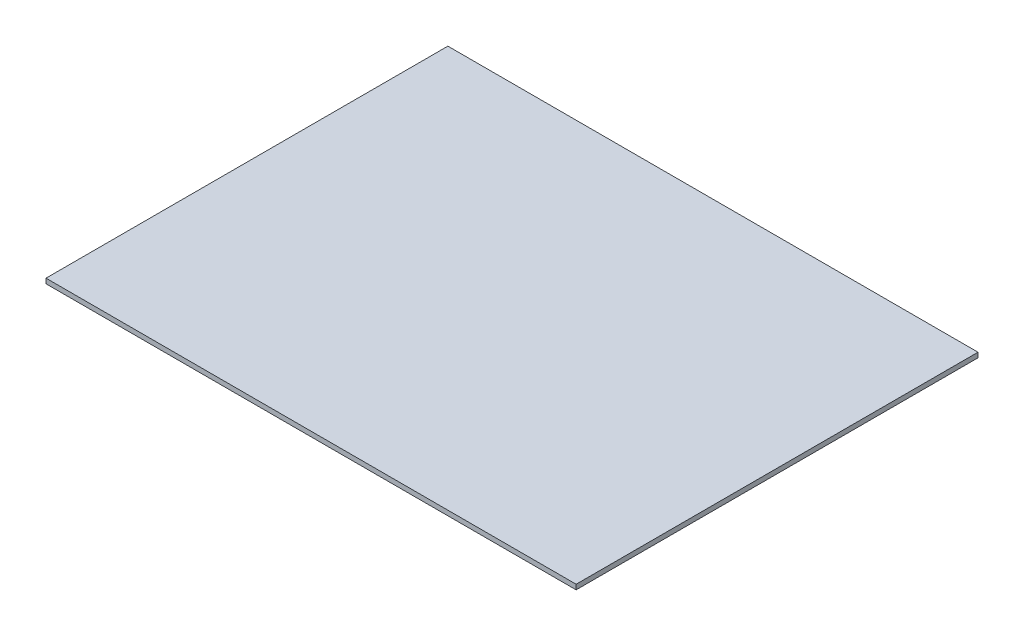
ISO-10303-21;
HEADER;
FILE_DESCRIPTION(('STEP AP214'),'2;1');
FILE_NAME('part.step','',(''),(''),'','','');
FILE_SCHEMA(('AUTOMOTIVE_DESIGN { 1 0 10303 214 1 1 1 1 }'));
ENDSEC;
DATA;
#1=APPLICATION_CONTEXT('core data for automotive mechanical design processes');
#2=APPLICATION_PROTOCOL_DEFINITION('international standard','automotive_design',2000,#1);
#3=PRODUCT_CONTEXT('',#1,'mechanical');
#4=PRODUCT('Part','Part','',(#3));
#5=PRODUCT_RELATED_PRODUCT_CATEGORY('part','',(#4));
#6=PRODUCT_DEFINITION_FORMATION('','',#4);
#7=PRODUCT_DEFINITION_CONTEXT('part definition',#1,'design');
#8=PRODUCT_DEFINITION('design','',#6,#7);
#9=PRODUCT_DEFINITION_SHAPE('','',#8);
#10=(LENGTH_UNIT() NAMED_UNIT(*) SI_UNIT(.MILLI.,.METRE.));
#11=(NAMED_UNIT(*) PLANE_ANGLE_UNIT() SI_UNIT($,.RADIAN.));
#12=(NAMED_UNIT(*) SI_UNIT($,.STERADIAN.) SOLID_ANGLE_UNIT());
#13=UNCERTAINTY_MEASURE_WITH_UNIT(LENGTH_MEASURE(1.E-05),#10,'distance_accuracy_value','');
#14=(GEOMETRIC_REPRESENTATION_CONTEXT(3) GLOBAL_UNCERTAINTY_ASSIGNED_CONTEXT((#13)) GLOBAL_UNIT_ASSIGNED_CONTEXT((#10,
#11,#12)) REPRESENTATION_CONTEXT('',''));
#15=CARTESIAN_POINT('',(0.,0.,0.));
#16=DIRECTION('',(0.,0.,1.));
#17=DIRECTION('',(1.,0.,0.));
#18=AXIS2_PLACEMENT_3D('',#15,#16,#17);
#19=CARTESIAN_POINT('',(217.,4.,164.5));
#20=DIRECTION('',(-1.,0.,0.));
#21=DIRECTION('',(0.,0.,1.));
#22=AXIS2_PLACEMENT_3D('',#19,#20,#21);
#23=PLANE('',#22);
#24=DIRECTION('',(0.,0.,-1.));
#25=VECTOR('',#24,1.);
#26=CARTESIAN_POINT('',(217.,0.,164.5));
#27=LINE('',#26,#25);
#28=CARTESIAN_POINT('',(217.,0.,164.5));
#29=VERTEX_POINT('',#28);
#30=CARTESIAN_POINT('',(217.,0.,-164.5));
#31=VERTEX_POINT('',#30);
#32=EDGE_CURVE('E98',#29,#31,#27,.T.);
#33=ORIENTED_EDGE('',*,*,#32,.T.);
#34=DIRECTION('',(0.,-1.,0.));
#35=VECTOR('',#34,1.);
#36=CARTESIAN_POINT('',(217.,4.,-164.5));
#37=LINE('',#36,#35);
#38=CARTESIAN_POINT('',(217.,4.,-164.5));
#39=VERTEX_POINT('',#38);
#40=EDGE_CURVE('E11',#39,#31,#37,.T.);
#41=ORIENTED_EDGE('',*,*,#40,.F.);
#42=DIRECTION('',(0.,0.,-1.));
#43=VECTOR('',#42,1.);
#44=CARTESIAN_POINT('',(217.,4.,164.5));
#45=LINE('',#44,#43);
#46=CARTESIAN_POINT('',(217.,4.,164.5));
#47=VERTEX_POINT('',#46);
#48=EDGE_CURVE('E86',#47,#39,#45,.T.);
#49=ORIENTED_EDGE('',*,*,#48,.F.);
#50=DIRECTION('',(0.,-1.,0.));
#51=VECTOR('',#50,1.);
#52=CARTESIAN_POINT('',(217.,4.,164.5));
#53=LINE('',#52,#51);
#54=EDGE_CURVE('E94',#47,#29,#53,.T.);
#55=ORIENTED_EDGE('',*,*,#54,.T.);
#56=EDGE_LOOP('',(#33,#41,#49,#55));
#57=FACE_BOUND('',#56,.T.);
#58=ADVANCED_FACE('F35',(#57),#23,.F.);
#59=CARTESIAN_POINT('',(-217.,4.,-164.5));
#60=DIRECTION('',(0.,0.,1.));
#61=DIRECTION('',(1.,0.,0.));
#62=AXIS2_PLACEMENT_3D('',#59,#60,#61);
#63=PLANE('',#62);
#64=DIRECTION('',(-1.,0.,0.));
#65=VECTOR('',#64,1.);
#66=CARTESIAN_POINT('',(-217.,0.,-164.5));
#67=LINE('',#66,#65);
#68=CARTESIAN_POINT('',(-217.,0.,-164.5));
#69=VERTEX_POINT('',#68);
#70=EDGE_CURVE('E90',#31,#69,#67,.T.);
#71=ORIENTED_EDGE('',*,*,#70,.T.);
#72=DIRECTION('',(0.,-1.,0.));
#73=VECTOR('',#72,1.);
#74=CARTESIAN_POINT('',(-217.,4.,-164.5));
#75=LINE('',#74,#73);
#76=CARTESIAN_POINT('',(-217.,4.,-164.5));
#77=VERTEX_POINT('',#76);
#78=EDGE_CURVE('E43',#77,#69,#75,.T.);
#79=ORIENTED_EDGE('',*,*,#78,.F.);
#80=DIRECTION('',(-1.,0.,0.));
#81=VECTOR('',#80,1.);
#82=CARTESIAN_POINT('',(-217.,4.,-164.5));
#83=LINE('',#82,#81);
#84=EDGE_CURVE('E81',#39,#77,#83,.T.);
#85=ORIENTED_EDGE('',*,*,#84,.F.);
#86=ORIENTED_EDGE('',*,*,#40,.T.);
#87=EDGE_LOOP('',(#71,#79,#85,#86));
#88=FACE_BOUND('',#87,.T.);
#89=ADVANCED_FACE('F89',(#88),#63,.F.);
#90=CARTESIAN_POINT('',(-217.,4.,164.5));
#91=DIRECTION('',(1.,0.,0.));
#92=DIRECTION('',(0.,0.,-1.));
#93=AXIS2_PLACEMENT_3D('',#90,#91,#92);
#94=PLANE('',#93);
#95=DIRECTION('',(0.,0.,1.));
#96=VECTOR('',#95,1.);
#97=CARTESIAN_POINT('',(-217.,0.,164.5));
#98=LINE('',#97,#96);
#99=CARTESIAN_POINT('',(-217.,0.,164.5));
#100=VERTEX_POINT('',#99);
#101=EDGE_CURVE('E68',#69,#100,#98,.T.);
#102=ORIENTED_EDGE('',*,*,#101,.T.);
#103=DIRECTION('',(0.,-1.,0.));
#104=VECTOR('',#103,1.);
#105=CARTESIAN_POINT('',(-217.,4.,164.5));
#106=LINE('',#105,#104);
#107=CARTESIAN_POINT('',(-217.,4.,164.5));
#108=VERTEX_POINT('',#107);
#109=EDGE_CURVE('E91',#108,#100,#106,.T.);
#110=ORIENTED_EDGE('',*,*,#109,.F.);
#111=DIRECTION('',(0.,0.,1.));
#112=VECTOR('',#111,1.);
#113=CARTESIAN_POINT('',(-217.,4.,164.5));
#114=LINE('',#113,#112);
#115=EDGE_CURVE('E84',#77,#108,#114,.T.);
#116=ORIENTED_EDGE('',*,*,#115,.F.);
#117=ORIENTED_EDGE('',*,*,#78,.T.);
#118=EDGE_LOOP('',(#102,#110,#116,#117));
#119=FACE_BOUND('',#118,.T.);
#120=ADVANCED_FACE('F92',(#119),#94,.F.);
#121=CARTESIAN_POINT('',(-217.,4.,164.5));
#122=DIRECTION('',(0.,0.,-1.));
#123=DIRECTION('',(-1.,0.,0.));
#124=AXIS2_PLACEMENT_3D('',#121,#122,#123);
#125=PLANE('',#124);
#126=DIRECTION('',(1.,0.,0.));
#127=VECTOR('',#126,1.);
#128=CARTESIAN_POINT('',(-217.,0.,164.5));
#129=LINE('',#128,#127);
#130=EDGE_CURVE('E74',#100,#29,#129,.T.);
#131=ORIENTED_EDGE('',*,*,#130,.T.);
#132=ORIENTED_EDGE('',*,*,#54,.F.);
#133=DIRECTION('',(1.,0.,0.));
#134=VECTOR('',#133,1.);
#135=CARTESIAN_POINT('',(-217.,4.,164.5));
#136=LINE('',#135,#134);
#137=EDGE_CURVE('E51',#108,#47,#136,.T.);
#138=ORIENTED_EDGE('',*,*,#137,.F.);
#139=ORIENTED_EDGE('',*,*,#109,.T.);
#140=EDGE_LOOP('',(#131,#132,#138,#139));
#141=FACE_BOUND('',#140,.T.);
#142=ADVANCED_FACE('F105',(#141),#125,.F.);
#143=CARTESIAN_POINT('',(0.,4.,0.));
#144=DIRECTION('',(0.,-1.,0.));
#145=DIRECTION('',(0.,0.,-1.));
#146=AXIS2_PLACEMENT_3D('',#143,#144,#145);
#147=PLANE('',#146);
#148=ORIENTED_EDGE('',*,*,#48,.T.);
#149=ORIENTED_EDGE('',*,*,#84,.T.);
#150=ORIENTED_EDGE('',*,*,#115,.T.);
#151=ORIENTED_EDGE('',*,*,#137,.T.);
#152=EDGE_LOOP('',(#148,#149,#150,#151));
#153=FACE_BOUND('',#152,.T.);
#154=ADVANCED_FACE('F82',(#153),#147,.F.);
#155=CARTESIAN_POINT('',(0.,0.,0.));
#156=DIRECTION('',(0.,-1.,0.));
#157=DIRECTION('',(0.,0.,-1.));
#158=AXIS2_PLACEMENT_3D('',#155,#156,#157);
#159=PLANE('',#158);
#160=ORIENTED_EDGE('',*,*,#32,.F.);
#161=ORIENTED_EDGE('',*,*,#130,.F.);
#162=ORIENTED_EDGE('',*,*,#101,.F.);
#163=ORIENTED_EDGE('',*,*,#70,.F.);
#164=EDGE_LOOP('',(#160,#161,#162,#163));
#165=FACE_BOUND('',#164,.T.);
#166=ADVANCED_FACE('F108',(#165),#159,.T.);
#167=CLOSED_SHELL('',(#58,#89,#120,#142,#154,#166));
#168=MANIFOLD_SOLID_BREP('B2',#167);
#169=ADVANCED_BREP_SHAPE_REPRESENTATION('',(#18,#168),#14);
#170=SHAPE_DEFINITION_REPRESENTATION(#9,#169);
ENDSEC;
END-ISO-10303-21;
